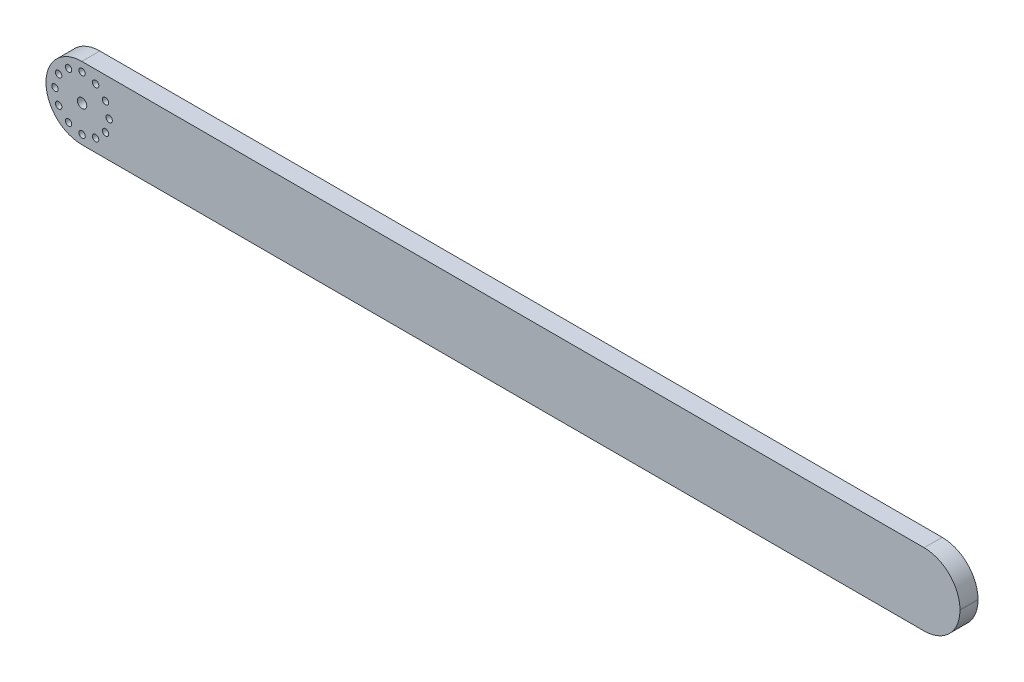
ISO-10303-21;
HEADER;
FILE_DESCRIPTION(('STEP AP214'),'2;1');
FILE_NAME('part.step','',(''),(''),'','','');
FILE_SCHEMA(('AUTOMOTIVE_DESIGN { 1 0 10303 214 1 1 1 1 }'));
ENDSEC;
DATA;
#1=APPLICATION_CONTEXT('core data for automotive mechanical design processes');
#2=APPLICATION_PROTOCOL_DEFINITION('international standard','automotive_design',2000,#1);
#3=PRODUCT_CONTEXT('',#1,'mechanical');
#4=PRODUCT('Part','Part','',(#3));
#5=PRODUCT_RELATED_PRODUCT_CATEGORY('part','',(#4));
#6=PRODUCT_DEFINITION_FORMATION('','',#4);
#7=PRODUCT_DEFINITION_CONTEXT('part definition',#1,'design');
#8=PRODUCT_DEFINITION('design','',#6,#7);
#9=PRODUCT_DEFINITION_SHAPE('','',#8);
#10=(LENGTH_UNIT() NAMED_UNIT(*) SI_UNIT(.MILLI.,.METRE.));
#11=(NAMED_UNIT(*) PLANE_ANGLE_UNIT() SI_UNIT($,.RADIAN.));
#12=(NAMED_UNIT(*) SI_UNIT($,.STERADIAN.) SOLID_ANGLE_UNIT());
#13=UNCERTAINTY_MEASURE_WITH_UNIT(LENGTH_MEASURE(1.E-05),#10,'distance_accuracy_value','');
#14=(GEOMETRIC_REPRESENTATION_CONTEXT(3) GLOBAL_UNCERTAINTY_ASSIGNED_CONTEXT((#13)) GLOBAL_UNIT_ASSIGNED_CONTEXT((#10,
#11,#12)) REPRESENTATION_CONTEXT('',''));
#15=CARTESIAN_POINT('',(0.,0.,0.));
#16=DIRECTION('',(0.,0.,1.));
#17=DIRECTION('',(1.,0.,0.));
#18=AXIS2_PLACEMENT_3D('',#15,#16,#17);
#19=CARTESIAN_POINT('',(927.354,-38.354,0.));
#20=DIRECTION('',(0.,0.,-1.));
#21=DIRECTION('',(-1.,0.,0.));
#22=AXIS2_PLACEMENT_3D('',#19,#20,#21);
#23=PLANE('',#22);
#24=CARTESIAN_POINT('',(52.3875000000003,-13.3533240868598,0.));
#25=DIRECTION('',(0.,0.,1.));
#26=DIRECTION('',(1.,0.,0.));
#27=AXIS2_PLACEMENT_3D('',#24,#25,#26);
#28=CIRCLE('',#27,3.37343749999999);
#29=CARTESIAN_POINT('',(55.7609375000003,-13.3533240868598,0.));
#30=VERTEX_POINT('',#29);
#31=EDGE_CURVE('E287',#30,#30,#28,.T.);
#32=ORIENTED_EDGE('',*,*,#31,.T.);
#33=EDGE_LOOP('',(#32));
#34=FACE_BOUND('',#33,.T.);
#35=CARTESIAN_POINT('',(23.8125000000002,-13.3533240868595,0.));
#36=DIRECTION('',(0.,0.,1.));
#37=DIRECTION('',(1.,0.,0.));
#38=AXIS2_PLACEMENT_3D('',#35,#36,#37);
#39=CIRCLE('',#38,3.37343749999999);
#40=CARTESIAN_POINT('',(27.1859375000002,-13.3533240868595,0.));
#41=VERTEX_POINT('',#40);
#42=EDGE_CURVE('E275',#41,#41,#39,.T.);
#43=ORIENTED_EDGE('',*,*,#42,.T.);
#44=EDGE_LOOP('',(#43));
#45=FACE_BOUND('',#44,.T.);
#46=CARTESIAN_POINT('',(9.52500000000002,-38.0999999999994,0.));
#47=DIRECTION('',(0.,0.,1.));
#48=DIRECTION('',(1.,0.,0.));
#49=AXIS2_PLACEMENT_3D('',#46,#47,#48);
#50=CIRCLE('',#49,3.37343749999999);
#51=CARTESIAN_POINT('',(12.8984375,-38.0999999999994,0.));
#52=VERTEX_POINT('',#51);
#53=EDGE_CURVE('E263',#52,#52,#50,.T.);
#54=ORIENTED_EDGE('',*,*,#53,.T.);
#55=EDGE_LOOP('',(#54));
#56=FACE_BOUND('',#55,.T.);
#57=CARTESIAN_POINT('',(23.8124999999995,-62.8466759131401,0.));
#58=DIRECTION('',(0.,0.,1.));
#59=DIRECTION('',(1.,0.,0.));
#60=AXIS2_PLACEMENT_3D('',#57,#58,#59);
#61=CIRCLE('',#60,3.37343749999999);
#62=CARTESIAN_POINT('',(27.1859374999995,-62.8466759131401,0.));
#63=VERTEX_POINT('',#62);
#64=EDGE_CURVE('E251',#63,#63,#61,.T.);
#65=ORIENTED_EDGE('',*,*,#64,.T.);
#66=EDGE_LOOP('',(#65));
#67=FACE_BOUND('',#66,.T.);
#68=CARTESIAN_POINT('',(52.3874999999996,-62.8466759131406,0.));
#69=DIRECTION('',(0.,0.,1.));
#70=DIRECTION('',(1.,0.,0.));
#71=AXIS2_PLACEMENT_3D('',#68,#69,#70);
#72=CIRCLE('',#71,3.37343749999999);
#73=CARTESIAN_POINT('',(55.7609374999996,-62.8466759131406,0.));
#74=VERTEX_POINT('',#73);
#75=EDGE_CURVE('E239',#74,#74,#72,.T.);
#76=ORIENTED_EDGE('',*,*,#75,.T.);
#77=EDGE_LOOP('',(#76));
#78=FACE_BOUND('',#77,.T.);
#79=CARTESIAN_POINT('',(66.675,-38.1,0.));
#80=DIRECTION('',(0.,0.,1.));
#81=DIRECTION('',(1.,0.,0.));
#82=AXIS2_PLACEMENT_3D('',#79,#80,#81);
#83=CIRCLE('',#82,3.37343749999999);
#84=CARTESIAN_POINT('',(70.0484375,-38.1,0.));
#85=VERTEX_POINT('',#84);
#86=EDGE_CURVE('E227',#85,#85,#83,.T.);
#87=ORIENTED_EDGE('',*,*,#86,.T.);
#88=EDGE_LOOP('',(#87));
#89=FACE_BOUND('',#88,.T.);
#90=CARTESIAN_POINT('',(482.6,-38.1000000000025,0.));
#91=DIRECTION('',(0.,0.,1.));
#92=DIRECTION('',(1.,0.,0.));
#93=AXIS2_PLACEMENT_3D('',#90,#91,#92);
#94=CIRCLE('',#93,16.66875);
#95=CARTESIAN_POINT('',(499.26875,-38.1000000000025,0.));
#96=VERTEX_POINT('',#95);
#97=EDGE_CURVE('E215',#96,#96,#94,.T.);
#98=ORIENTED_EDGE('',*,*,#97,.T.);
#99=EDGE_LOOP('',(#98));
#100=FACE_BOUND('',#99,.T.);
#101=CARTESIAN_POINT('',(723.9,-38.1000000000008,0.));
#102=DIRECTION('',(0.,0.,1.));
#103=DIRECTION('',(1.,0.,0.));
#104=AXIS2_PLACEMENT_3D('',#101,#102,#103);
#105=CIRCLE('',#104,16.66875);
#106=CARTESIAN_POINT('',(740.56875,-38.1000000000008,0.));
#107=VERTEX_POINT('',#106);
#108=EDGE_CURVE('E203',#107,#107,#105,.T.);
#109=ORIENTED_EDGE('',*,*,#108,.T.);
#110=EDGE_LOOP('',(#109));
#111=FACE_BOUND('',#110,.T.);
#112=CARTESIAN_POINT('',(361.95,-38.1000000000034,0.));
#113=DIRECTION('',(0.,0.,1.));
#114=DIRECTION('',(1.,0.,0.));
#115=AXIS2_PLACEMENT_3D('',#112,#113,#114);
#116=CIRCLE('',#115,16.66875);
#117=CARTESIAN_POINT('',(378.61875,-38.1000000000034,0.));
#118=VERTEX_POINT('',#117);
#119=EDGE_CURVE('E191',#118,#118,#116,.T.);
#120=ORIENTED_EDGE('',*,*,#119,.T.);
#121=EDGE_LOOP('',(#120));
#122=FACE_BOUND('',#121,.T.);
#123=CARTESIAN_POINT('',(120.65,-38.1000000000051,0.));
#124=DIRECTION('',(0.,0.,1.));
#125=DIRECTION('',(1.,0.,0.));
#126=AXIS2_PLACEMENT_3D('',#123,#124,#125);
#127=CIRCLE('',#126,16.66875);
#128=CARTESIAN_POINT('',(137.31875,-38.1000000000051,0.));
#129=VERTEX_POINT('',#128);
#130=EDGE_CURVE('E179',#129,#129,#127,.T.);
#131=ORIENTED_EDGE('',*,*,#130,.T.);
#132=EDGE_LOOP('',(#131));
#133=FACE_BOUND('',#132,.T.);
#134=CARTESIAN_POINT('',(927.354,-38.354,0.));
#135=DIRECTION('',(0.,0.,1.));
#136=DIRECTION('',(-1.,0.,0.));
#137=AXIS2_PLACEMENT_3D('',#134,#135,#136);
#138=CIRCLE('',#137,37.8460000000001);
#139=CARTESIAN_POINT('',(927.354,-76.2,0.));
#140=VERTEX_POINT('',#139);
#141=CARTESIAN_POINT('',(965.2,-38.354,0.));
#142=VERTEX_POINT('',#141);
#143=EDGE_CURVE('E131',#140,#142,#138,.T.);
#144=ORIENTED_EDGE('',*,*,#143,.F.);
#145=DIRECTION('',(1.,0.,0.));
#146=VECTOR('',#145,1.);
#147=CARTESIAN_POINT('',(37.846,-76.2,0.));
#148=LINE('',#147,#146);
#149=CARTESIAN_POINT('',(37.846,-76.2,0.));
#150=VERTEX_POINT('',#149);
#151=EDGE_CURVE('E85',#150,#140,#148,.T.);
#152=ORIENTED_EDGE('',*,*,#151,.F.);
#153=CARTESIAN_POINT('',(37.846,-38.354,0.));
#154=DIRECTION('',(0.,0.,1.));
#155=DIRECTION('',(1.,0.,0.));
#156=AXIS2_PLACEMENT_3D('',#153,#154,#155);
#157=CIRCLE('',#156,37.846);
#158=CARTESIAN_POINT('',(0.,-38.354,0.));
#159=VERTEX_POINT('',#158);
#160=EDGE_CURVE('E79',#159,#150,#157,.T.);
#161=ORIENTED_EDGE('',*,*,#160,.F.);
#162=DIRECTION('',(0.,-1.,0.));
#163=VECTOR('',#162,1.);
#164=CARTESIAN_POINT('',(0.,-37.846,0.));
#165=LINE('',#164,#163);
#166=CARTESIAN_POINT('',(0.,-37.846,0.));
#167=VERTEX_POINT('',#166);
#168=EDGE_CURVE('E121',#167,#159,#165,.T.);
#169=ORIENTED_EDGE('',*,*,#168,.F.);
#170=CARTESIAN_POINT('',(37.846,-37.846,0.));
#171=DIRECTION('',(0.,0.,1.));
#172=DIRECTION('',(-1.,0.,0.));
#173=AXIS2_PLACEMENT_3D('',#170,#171,#172);
#174=CIRCLE('',#173,37.846);
#175=CARTESIAN_POINT('',(37.846,0.,0.));
#176=VERTEX_POINT('',#175);
#177=EDGE_CURVE('E141',#176,#167,#174,.T.);
#178=ORIENTED_EDGE('',*,*,#177,.F.);
#179=DIRECTION('',(-1.,0.,0.));
#180=VECTOR('',#179,1.);
#181=CARTESIAN_POINT('',(37.846,0.,0.));
#182=LINE('',#181,#180);
#183=CARTESIAN_POINT('',(927.354,0.,0.));
#184=VERTEX_POINT('',#183);
#185=EDGE_CURVE('E139',#184,#176,#182,.T.);
#186=ORIENTED_EDGE('',*,*,#185,.F.);
#187=CARTESIAN_POINT('',(927.354,-37.846,0.));
#188=DIRECTION('',(0.,0.,1.));
#189=DIRECTION('',(1.,0.,0.));
#190=AXIS2_PLACEMENT_3D('',#187,#188,#189);
#191=CIRCLE('',#190,37.8460000000001);
#192=CARTESIAN_POINT('',(965.2,-37.846,0.));
#193=VERTEX_POINT('',#192);
#194=EDGE_CURVE('E137',#193,#184,#191,.T.);
#195=ORIENTED_EDGE('',*,*,#194,.F.);
#196=DIRECTION('',(0.,1.,0.));
#197=VECTOR('',#196,1.);
#198=CARTESIAN_POINT('',(965.2,-37.846,0.));
#199=LINE('',#198,#197);
#200=EDGE_CURVE('E134',#142,#193,#199,.T.);
#201=ORIENTED_EDGE('',*,*,#200,.F.);
#202=EDGE_LOOP('',(#144,#152,#161,#169,#178,#186,#195,#201));
#203=FACE_BOUND('',#202,.T.);
#204=CARTESIAN_POINT('',(241.3,-38.1000000000042,0.));
#205=DIRECTION('',(0.,0.,1.));
#206=DIRECTION('',(1.,0.,0.));
#207=AXIS2_PLACEMENT_3D('',#204,#205,#206);
#208=CIRCLE('',#207,16.66875);
#209=CARTESIAN_POINT('',(257.96875,-38.1000000000042,0.));
#210=VERTEX_POINT('',#209);
#211=EDGE_CURVE('E185',#210,#210,#208,.T.);
#212=ORIENTED_EDGE('',*,*,#211,.T.);
#213=EDGE_LOOP('',(#212));
#214=FACE_BOUND('',#213,.T.);
#215=CARTESIAN_POINT('',(844.55,-38.1,0.));
#216=DIRECTION('',(0.,0.,1.));
#217=DIRECTION('',(1.,0.,0.));
#218=AXIS2_PLACEMENT_3D('',#215,#216,#217);
#219=CIRCLE('',#218,16.66875);
#220=CARTESIAN_POINT('',(861.21875,-38.1,0.));
#221=VERTEX_POINT('',#220);
#222=EDGE_CURVE('E197',#221,#221,#219,.T.);
#223=ORIENTED_EDGE('',*,*,#222,.T.);
#224=EDGE_LOOP('',(#223));
#225=FACE_BOUND('',#224,.T.);
#226=CARTESIAN_POINT('',(603.25,-38.1000000000017,0.));
#227=DIRECTION('',(0.,0.,1.));
#228=DIRECTION('',(1.,0.,0.));
#229=AXIS2_PLACEMENT_3D('',#226,#227,#228);
#230=CIRCLE('',#229,16.66875);
#231=CARTESIAN_POINT('',(619.91875,-38.1000000000017,0.));
#232=VERTEX_POINT('',#231);
#233=EDGE_CURVE('E209',#232,#232,#230,.T.);
#234=ORIENTED_EDGE('',*,*,#233,.T.);
#235=EDGE_LOOP('',(#234));
#236=FACE_BOUND('',#235,.T.);
#237=CARTESIAN_POINT('',(38.1,-38.1,0.));
#238=DIRECTION('',(0.,0.,1.));
#239=DIRECTION('',(1.,0.,0.));
#240=AXIS2_PLACEMENT_3D('',#237,#238,#239);
#241=CIRCLE('',#240,4.96093750000001);
#242=CARTESIAN_POINT('',(43.0609375,-38.1,0.));
#243=VERTEX_POINT('',#242);
#244=EDGE_CURVE('E221',#243,#243,#241,.T.);
#245=ORIENTED_EDGE('',*,*,#244,.T.);
#246=EDGE_LOOP('',(#245));
#247=FACE_BOUND('',#246,.T.);
#248=CARTESIAN_POINT('',(62.8466759131401,-52.3875000000004,0.));
#249=DIRECTION('',(0.,0.,1.));
#250=DIRECTION('',(1.,0.,0.));
#251=AXIS2_PLACEMENT_3D('',#248,#249,#250);
#252=CIRCLE('',#251,3.37343749999999);
#253=CARTESIAN_POINT('',(66.2201134131401,-52.3875000000004,0.));
#254=VERTEX_POINT('',#253);
#255=EDGE_CURVE('E233',#254,#254,#252,.T.);
#256=ORIENTED_EDGE('',*,*,#255,.T.);
#257=EDGE_LOOP('',(#256));
#258=FACE_BOUND('',#257,.T.);
#259=CARTESIAN_POINT('',(38.0999999999995,-66.675,0.));
#260=DIRECTION('',(0.,0.,1.));
#261=DIRECTION('',(1.,0.,0.));
#262=AXIS2_PLACEMENT_3D('',#259,#260,#261);
#263=CIRCLE('',#262,3.3734375);
#264=CARTESIAN_POINT('',(41.4734374999995,-66.675,0.));
#265=VERTEX_POINT('',#264);
#266=EDGE_CURVE('E245',#265,#265,#263,.T.);
#267=ORIENTED_EDGE('',*,*,#266,.T.);
#268=EDGE_LOOP('',(#267));
#269=FACE_BOUND('',#268,.T.);
#270=CARTESIAN_POINT('',(13.3533240868594,-52.3874999999995,0.));
#271=DIRECTION('',(0.,0.,1.));
#272=DIRECTION('',(1.,0.,0.));
#273=AXIS2_PLACEMENT_3D('',#270,#271,#272);
#274=CIRCLE('',#273,3.37343749999998);
#275=CARTESIAN_POINT('',(16.7267615868594,-52.3874999999995,0.));
#276=VERTEX_POINT('',#275);
#277=EDGE_CURVE('E257',#276,#276,#274,.T.);
#278=ORIENTED_EDGE('',*,*,#277,.T.);
#279=EDGE_LOOP('',(#278));
#280=FACE_BOUND('',#279,.T.);
#281=CARTESIAN_POINT('',(13.35332408686,-23.8124999999995,0.));
#282=DIRECTION('',(0.,0.,1.));
#283=DIRECTION('',(1.,0.,0.));
#284=AXIS2_PLACEMENT_3D('',#281,#282,#283);
#285=CIRCLE('',#284,3.37343749999997);
#286=CARTESIAN_POINT('',(16.72676158686,-23.8124999999995,0.));
#287=VERTEX_POINT('',#286);
#288=EDGE_CURVE('E269',#287,#287,#285,.T.);
#289=ORIENTED_EDGE('',*,*,#288,.T.);
#290=EDGE_LOOP('',(#289));
#291=FACE_BOUND('',#290,.T.);
#292=CARTESIAN_POINT('',(38.1000000000003,-9.52500000000001,0.));
#293=DIRECTION('',(0.,0.,1.));
#294=DIRECTION('',(1.,0.,0.));
#295=AXIS2_PLACEMENT_3D('',#292,#293,#294);
#296=CIRCLE('',#295,3.3734375);
#297=CARTESIAN_POINT('',(41.4734375000003,-9.52500000000001,0.));
#298=VERTEX_POINT('',#297);
#299=EDGE_CURVE('E281',#298,#298,#296,.T.);
#300=ORIENTED_EDGE('',*,*,#299,.T.);
#301=EDGE_LOOP('',(#300));
#302=FACE_BOUND('',#301,.T.);
#303=CARTESIAN_POINT('',(62.8466759131405,-23.8125000000004,0.));
#304=DIRECTION('',(0.,0.,1.));
#305=DIRECTION('',(1.,0.,0.));
#306=AXIS2_PLACEMENT_3D('',#303,#304,#305);
#307=CIRCLE('',#306,3.37343749999998);
#308=CARTESIAN_POINT('',(66.2201134131405,-23.8125000000004,0.));
#309=VERTEX_POINT('',#308);
#310=EDGE_CURVE('E293',#309,#309,#307,.T.);
#311=ORIENTED_EDGE('',*,*,#310,.T.);
#312=EDGE_LOOP('',(#311));
#313=FACE_BOUND('',#312,.T.);
#314=ADVANCED_FACE('F33',(#34,#45,#56,#67,#78,#89,#100,#111,#122,#133,#203,#214,#225,#236,#247,
#258,#269,#280,#291,#302,#313),#23,.T.);
#315=CARTESIAN_POINT('',(927.354,-38.354,19.05));
#316=DIRECTION('',(0.,0.,-1.));
#317=DIRECTION('',(-1.,0.,0.));
#318=AXIS2_PLACEMENT_3D('',#315,#316,#317);
#319=PLANE('',#318);
#320=CARTESIAN_POINT('',(52.3875000000003,-13.3533240868598,19.05));
#321=DIRECTION('',(0.,0.,1.));
#322=DIRECTION('',(1.,0.,0.));
#323=AXIS2_PLACEMENT_3D('',#320,#321,#322);
#324=CIRCLE('',#323,3.37343749999999);
#325=CARTESIAN_POINT('',(55.7609375000003,-13.3533240868598,19.05));
#326=VERTEX_POINT('',#325);
#327=EDGE_CURVE('E284',#326,#326,#324,.T.);
#328=ORIENTED_EDGE('',*,*,#327,.F.);
#329=EDGE_LOOP('',(#328));
#330=FACE_BOUND('',#329,.T.);
#331=CARTESIAN_POINT('',(23.8125000000002,-13.3533240868595,19.05));
#332=DIRECTION('',(0.,0.,1.));
#333=DIRECTION('',(1.,0.,0.));
#334=AXIS2_PLACEMENT_3D('',#331,#332,#333);
#335=CIRCLE('',#334,3.37343749999999);
#336=CARTESIAN_POINT('',(27.1859375000002,-13.3533240868595,19.05));
#337=VERTEX_POINT('',#336);
#338=EDGE_CURVE('E272',#337,#337,#335,.T.);
#339=ORIENTED_EDGE('',*,*,#338,.F.);
#340=EDGE_LOOP('',(#339));
#341=FACE_BOUND('',#340,.T.);
#342=CARTESIAN_POINT('',(9.52500000000002,-38.0999999999994,19.05));
#343=DIRECTION('',(0.,0.,1.));
#344=DIRECTION('',(1.,0.,0.));
#345=AXIS2_PLACEMENT_3D('',#342,#343,#344);
#346=CIRCLE('',#345,3.37343749999999);
#347=CARTESIAN_POINT('',(12.8984375,-38.0999999999994,19.05));
#348=VERTEX_POINT('',#347);
#349=EDGE_CURVE('E260',#348,#348,#346,.T.);
#350=ORIENTED_EDGE('',*,*,#349,.F.);
#351=EDGE_LOOP('',(#350));
#352=FACE_BOUND('',#351,.T.);
#353=CARTESIAN_POINT('',(23.8124999999995,-62.8466759131401,19.05));
#354=DIRECTION('',(0.,0.,1.));
#355=DIRECTION('',(1.,0.,0.));
#356=AXIS2_PLACEMENT_3D('',#353,#354,#355);
#357=CIRCLE('',#356,3.37343749999999);
#358=CARTESIAN_POINT('',(27.1859374999995,-62.8466759131401,19.05));
#359=VERTEX_POINT('',#358);
#360=EDGE_CURVE('E248',#359,#359,#357,.T.);
#361=ORIENTED_EDGE('',*,*,#360,.F.);
#362=EDGE_LOOP('',(#361));
#363=FACE_BOUND('',#362,.T.);
#364=CARTESIAN_POINT('',(52.3874999999996,-62.8466759131406,19.05));
#365=DIRECTION('',(0.,0.,1.));
#366=DIRECTION('',(1.,0.,0.));
#367=AXIS2_PLACEMENT_3D('',#364,#365,#366);
#368=CIRCLE('',#367,3.37343749999999);
#369=CARTESIAN_POINT('',(55.7609374999996,-62.8466759131406,19.05));
#370=VERTEX_POINT('',#369);
#371=EDGE_CURVE('E236',#370,#370,#368,.T.);
#372=ORIENTED_EDGE('',*,*,#371,.F.);
#373=EDGE_LOOP('',(#372));
#374=FACE_BOUND('',#373,.T.);
#375=CARTESIAN_POINT('',(66.675,-38.1,19.05));
#376=DIRECTION('',(0.,0.,1.));
#377=DIRECTION('',(1.,0.,0.));
#378=AXIS2_PLACEMENT_3D('',#375,#376,#377);
#379=CIRCLE('',#378,3.37343749999999);
#380=CARTESIAN_POINT('',(70.0484375,-38.1,19.05));
#381=VERTEX_POINT('',#380);
#382=EDGE_CURVE('E224',#381,#381,#379,.T.);
#383=ORIENTED_EDGE('',*,*,#382,.F.);
#384=EDGE_LOOP('',(#383));
#385=FACE_BOUND('',#384,.T.);
#386=CARTESIAN_POINT('',(927.354,-38.354,19.05));
#387=DIRECTION('',(0.,0.,1.));
#388=DIRECTION('',(-1.,0.,0.));
#389=AXIS2_PLACEMENT_3D('',#386,#387,#388);
#390=CIRCLE('',#389,37.8460000000001);
#391=CARTESIAN_POINT('',(927.354,-76.2,19.05));
#392=VERTEX_POINT('',#391);
#393=CARTESIAN_POINT('',(965.2,-38.354,19.05));
#394=VERTEX_POINT('',#393);
#395=EDGE_CURVE('E146',#392,#394,#390,.T.);
#396=ORIENTED_EDGE('',*,*,#395,.T.);
#397=DIRECTION('',(0.,1.,0.));
#398=VECTOR('',#397,1.);
#399=CARTESIAN_POINT('',(965.2,-37.846,19.05));
#400=LINE('',#399,#398);
#401=CARTESIAN_POINT('',(965.2,-37.846,19.05));
#402=VERTEX_POINT('',#401);
#403=EDGE_CURVE('E93',#394,#402,#400,.T.);
#404=ORIENTED_EDGE('',*,*,#403,.T.);
#405=CARTESIAN_POINT('',(927.354,-37.846,19.05));
#406=DIRECTION('',(0.,0.,1.));
#407=DIRECTION('',(1.,0.,0.));
#408=AXIS2_PLACEMENT_3D('',#405,#406,#407);
#409=CIRCLE('',#408,37.8460000000001);
#410=CARTESIAN_POINT('',(927.354,0.,19.05));
#411=VERTEX_POINT('',#410);
#412=EDGE_CURVE('E161',#402,#411,#409,.T.);
#413=ORIENTED_EDGE('',*,*,#412,.T.);
#414=DIRECTION('',(-1.,0.,0.));
#415=VECTOR('',#414,1.);
#416=CARTESIAN_POINT('',(37.846,0.,19.05));
#417=LINE('',#416,#415);
#418=CARTESIAN_POINT('',(37.846,0.,19.05));
#419=VERTEX_POINT('',#418);
#420=EDGE_CURVE('E173',#411,#419,#417,.T.);
#421=ORIENTED_EDGE('',*,*,#420,.T.);
#422=CARTESIAN_POINT('',(37.846,-37.846,19.05));
#423=DIRECTION('',(0.,0.,1.));
#424=DIRECTION('',(-1.,0.,0.));
#425=AXIS2_PLACEMENT_3D('',#422,#423,#424);
#426=CIRCLE('',#425,37.846);
#427=CARTESIAN_POINT('',(0.,-37.846,19.05));
#428=VERTEX_POINT('',#427);
#429=EDGE_CURVE('E113',#419,#428,#426,.T.);
#430=ORIENTED_EDGE('',*,*,#429,.T.);
#431=DIRECTION('',(0.,-1.,0.));
#432=VECTOR('',#431,1.);
#433=CARTESIAN_POINT('',(0.,-37.846,19.05));
#434=LINE('',#433,#432);
#435=CARTESIAN_POINT('',(0.,-38.354,19.05));
#436=VERTEX_POINT('',#435);
#437=EDGE_CURVE('E106',#428,#436,#434,.T.);
#438=ORIENTED_EDGE('',*,*,#437,.T.);
#439=CARTESIAN_POINT('',(37.846,-38.354,19.05));
#440=DIRECTION('',(0.,0.,1.));
#441=DIRECTION('',(1.,0.,0.));
#442=AXIS2_PLACEMENT_3D('',#439,#440,#441);
#443=CIRCLE('',#442,37.846);
#444=CARTESIAN_POINT('',(37.846,-76.2,19.05));
#445=VERTEX_POINT('',#444);
#446=EDGE_CURVE('E111',#436,#445,#443,.T.);
#447=ORIENTED_EDGE('',*,*,#446,.T.);
#448=DIRECTION('',(1.,0.,0.));
#449=VECTOR('',#448,1.);
#450=CARTESIAN_POINT('',(37.846,-76.2,19.05));
#451=LINE('',#450,#449);
#452=EDGE_CURVE('E50',#445,#392,#451,.T.);
#453=ORIENTED_EDGE('',*,*,#452,.T.);
#454=EDGE_LOOP('',(#396,#404,#413,#421,#430,#438,#447,#453));
#455=FACE_BOUND('',#454,.T.);
#456=CARTESIAN_POINT('',(38.1,-38.1,19.05));
#457=DIRECTION('',(0.,0.,1.));
#458=DIRECTION('',(1.,0.,0.));
#459=AXIS2_PLACEMENT_3D('',#456,#457,#458);
#460=CIRCLE('',#459,4.96093750000001);
#461=CARTESIAN_POINT('',(43.0609375,-38.1,19.05));
#462=VERTEX_POINT('',#461);
#463=EDGE_CURVE('E218',#462,#462,#460,.T.);
#464=ORIENTED_EDGE('',*,*,#463,.F.);
#465=EDGE_LOOP('',(#464));
#466=FACE_BOUND('',#465,.T.);
#467=CARTESIAN_POINT('',(62.8466759131401,-52.3875000000004,19.05));
#468=DIRECTION('',(0.,0.,1.));
#469=DIRECTION('',(1.,0.,0.));
#470=AXIS2_PLACEMENT_3D('',#467,#468,#469);
#471=CIRCLE('',#470,3.37343749999999);
#472=CARTESIAN_POINT('',(66.2201134131401,-52.3875000000004,19.05));
#473=VERTEX_POINT('',#472);
#474=EDGE_CURVE('E230',#473,#473,#471,.T.);
#475=ORIENTED_EDGE('',*,*,#474,.F.);
#476=EDGE_LOOP('',(#475));
#477=FACE_BOUND('',#476,.T.);
#478=CARTESIAN_POINT('',(38.0999999999995,-66.675,19.05));
#479=DIRECTION('',(0.,0.,1.));
#480=DIRECTION('',(1.,0.,0.));
#481=AXIS2_PLACEMENT_3D('',#478,#479,#480);
#482=CIRCLE('',#481,3.3734375);
#483=CARTESIAN_POINT('',(41.4734374999995,-66.675,19.05));
#484=VERTEX_POINT('',#483);
#485=EDGE_CURVE('E242',#484,#484,#482,.T.);
#486=ORIENTED_EDGE('',*,*,#485,.F.);
#487=EDGE_LOOP('',(#486));
#488=FACE_BOUND('',#487,.T.);
#489=CARTESIAN_POINT('',(13.3533240868594,-52.3874999999995,19.05));
#490=DIRECTION('',(0.,0.,1.));
#491=DIRECTION('',(1.,0.,0.));
#492=AXIS2_PLACEMENT_3D('',#489,#490,#491);
#493=CIRCLE('',#492,3.37343749999998);
#494=CARTESIAN_POINT('',(16.7267615868594,-52.3874999999995,19.05));
#495=VERTEX_POINT('',#494);
#496=EDGE_CURVE('E254',#495,#495,#493,.T.);
#497=ORIENTED_EDGE('',*,*,#496,.F.);
#498=EDGE_LOOP('',(#497));
#499=FACE_BOUND('',#498,.T.);
#500=CARTESIAN_POINT('',(13.35332408686,-23.8124999999995,19.05));
#501=DIRECTION('',(0.,0.,1.));
#502=DIRECTION('',(1.,0.,0.));
#503=AXIS2_PLACEMENT_3D('',#500,#501,#502);
#504=CIRCLE('',#503,3.37343749999997);
#505=CARTESIAN_POINT('',(16.72676158686,-23.8124999999995,19.05));
#506=VERTEX_POINT('',#505);
#507=EDGE_CURVE('E266',#506,#506,#504,.T.);
#508=ORIENTED_EDGE('',*,*,#507,.F.);
#509=EDGE_LOOP('',(#508));
#510=FACE_BOUND('',#509,.T.);
#511=CARTESIAN_POINT('',(38.1000000000003,-9.52500000000001,19.05));
#512=DIRECTION('',(0.,0.,1.));
#513=DIRECTION('',(1.,0.,0.));
#514=AXIS2_PLACEMENT_3D('',#511,#512,#513);
#515=CIRCLE('',#514,3.3734375);
#516=CARTESIAN_POINT('',(41.4734375000003,-9.52500000000001,19.05));
#517=VERTEX_POINT('',#516);
#518=EDGE_CURVE('E278',#517,#517,#515,.T.);
#519=ORIENTED_EDGE('',*,*,#518,.F.);
#520=EDGE_LOOP('',(#519));
#521=FACE_BOUND('',#520,.T.);
#522=CARTESIAN_POINT('',(62.8466759131405,-23.8125000000004,19.05));
#523=DIRECTION('',(0.,0.,1.));
#524=DIRECTION('',(1.,0.,0.));
#525=AXIS2_PLACEMENT_3D('',#522,#523,#524);
#526=CIRCLE('',#525,3.37343749999998);
#527=CARTESIAN_POINT('',(66.2201134131405,-23.8125000000004,19.05));
#528=VERTEX_POINT('',#527);
#529=EDGE_CURVE('E290',#528,#528,#526,.T.);
#530=ORIENTED_EDGE('',*,*,#529,.F.);
#531=EDGE_LOOP('',(#530));
#532=FACE_BOUND('',#531,.T.);
#533=ADVANCED_FACE('F108',(#330,#341,#352,#363,#374,#385,#455,#466,#477,#488,#499,#510,#521,
#532),#319,.F.);
#534=CARTESIAN_POINT('',(927.354,-38.354,19.05));
#535=DIRECTION('',(0.,0.,-1.));
#536=DIRECTION('',(-1.,0.,0.));
#537=AXIS2_PLACEMENT_3D('',#534,#535,#536);
#538=CYLINDRICAL_SURFACE('',#537,37.8460000000001);
#539=ORIENTED_EDGE('',*,*,#143,.T.);
#540=DIRECTION('',(0.,0.,-1.));
#541=VECTOR('',#540,1.);
#542=CARTESIAN_POINT('',(965.2,-38.354,19.05));
#543=LINE('',#542,#541);
#544=EDGE_CURVE('E11',#394,#142,#543,.T.);
#545=ORIENTED_EDGE('',*,*,#544,.F.);
#546=ORIENTED_EDGE('',*,*,#395,.F.);
#547=DIRECTION('',(0.,0.,-1.));
#548=VECTOR('',#547,1.);
#549=CARTESIAN_POINT('',(927.354,-76.2,19.05));
#550=LINE('',#549,#548);
#551=EDGE_CURVE('E127',#392,#140,#550,.T.);
#552=ORIENTED_EDGE('',*,*,#551,.T.);
#553=EDGE_LOOP('',(#539,#545,#546,#552));
#554=FACE_BOUND('',#553,.T.);
#555=ADVANCED_FACE('F35',(#554),#538,.T.);
#556=CARTESIAN_POINT('',(965.2,-37.846,19.05));
#557=DIRECTION('',(-1.,0.,0.));
#558=DIRECTION('',(0.,0.,1.));
#559=AXIS2_PLACEMENT_3D('',#556,#557,#558);
#560=PLANE('',#559);
#561=ORIENTED_EDGE('',*,*,#200,.T.);
#562=DIRECTION('',(0.,0.,-1.));
#563=VECTOR('',#562,1.);
#564=CARTESIAN_POINT('',(965.2,-37.846,19.05));
#565=LINE('',#564,#563);
#566=EDGE_CURVE('E42',#402,#193,#565,.T.);
#567=ORIENTED_EDGE('',*,*,#566,.F.);
#568=ORIENTED_EDGE('',*,*,#403,.F.);
#569=ORIENTED_EDGE('',*,*,#544,.T.);
#570=EDGE_LOOP('',(#561,#567,#568,#569));
#571=FACE_BOUND('',#570,.T.);
#572=ADVANCED_FACE('F309',(#571),#560,.F.);
#573=CARTESIAN_POINT('',(927.354,-37.846,19.05));
#574=DIRECTION('',(0.,0.,-1.));
#575=DIRECTION('',(-1.,0.,0.));
#576=AXIS2_PLACEMENT_3D('',#573,#574,#575);
#577=CYLINDRICAL_SURFACE('',#576,37.8460000000001);
#578=ORIENTED_EDGE('',*,*,#194,.T.);
#579=DIRECTION('',(0.,0.,-1.));
#580=VECTOR('',#579,1.);
#581=CARTESIAN_POINT('',(927.354,0.,19.05));
#582=LINE('',#581,#580);
#583=EDGE_CURVE('E153',#411,#184,#582,.T.);
#584=ORIENTED_EDGE('',*,*,#583,.F.);
#585=ORIENTED_EDGE('',*,*,#412,.F.);
#586=ORIENTED_EDGE('',*,*,#566,.T.);
#587=EDGE_LOOP('',(#578,#584,#585,#586));
#588=FACE_BOUND('',#587,.T.);
#589=ADVANCED_FACE('F159',(#588),#577,.T.);
#590=CARTESIAN_POINT('',(37.846,0.,19.05));
#591=DIRECTION('',(0.,-1.,0.));
#592=DIRECTION('',(0.,0.,-1.));
#593=AXIS2_PLACEMENT_3D('',#590,#591,#592);
#594=PLANE('',#593);
#595=ORIENTED_EDGE('',*,*,#185,.T.);
#596=DIRECTION('',(0.,0.,-1.));
#597=VECTOR('',#596,1.);
#598=CARTESIAN_POINT('',(37.846,0.,19.05));
#599=LINE('',#598,#597);
#600=EDGE_CURVE('E150',#419,#176,#599,.T.);
#601=ORIENTED_EDGE('',*,*,#600,.F.);
#602=ORIENTED_EDGE('',*,*,#420,.F.);
#603=ORIENTED_EDGE('',*,*,#583,.T.);
#604=EDGE_LOOP('',(#595,#601,#602,#603));
#605=FACE_BOUND('',#604,.T.);
#606=ADVANCED_FACE('F169',(#605),#594,.F.);
#607=CARTESIAN_POINT('',(37.846,-37.846,19.05));
#608=DIRECTION('',(0.,0.,-1.));
#609=DIRECTION('',(-1.,0.,0.));
#610=AXIS2_PLACEMENT_3D('',#607,#608,#609);
#611=CYLINDRICAL_SURFACE('',#610,37.846);
#612=ORIENTED_EDGE('',*,*,#177,.T.);
#613=DIRECTION('',(0.,0.,-1.));
#614=VECTOR('',#613,1.);
#615=CARTESIAN_POINT('',(0.,-37.846,19.05));
#616=LINE('',#615,#614);
#617=EDGE_CURVE('E122',#428,#167,#616,.T.);
#618=ORIENTED_EDGE('',*,*,#617,.F.);
#619=ORIENTED_EDGE('',*,*,#429,.F.);
#620=ORIENTED_EDGE('',*,*,#600,.T.);
#621=EDGE_LOOP('',(#612,#618,#619,#620));
#622=FACE_BOUND('',#621,.T.);
#623=ADVANCED_FACE('F172',(#622),#611,.T.);
#624=CARTESIAN_POINT('',(0.,-37.846,19.05));
#625=DIRECTION('',(1.,0.,0.));
#626=DIRECTION('',(0.,0.,-1.));
#627=AXIS2_PLACEMENT_3D('',#624,#625,#626);
#628=PLANE('',#627);
#629=ORIENTED_EDGE('',*,*,#168,.T.);
#630=DIRECTION('',(0.,0.,-1.));
#631=VECTOR('',#630,1.);
#632=CARTESIAN_POINT('',(0.,-38.354,19.05));
#633=LINE('',#632,#631);
#634=EDGE_CURVE('E118',#436,#159,#633,.T.);
#635=ORIENTED_EDGE('',*,*,#634,.F.);
#636=ORIENTED_EDGE('',*,*,#437,.F.);
#637=ORIENTED_EDGE('',*,*,#617,.T.);
#638=EDGE_LOOP('',(#629,#635,#636,#637));
#639=FACE_BOUND('',#638,.T.);
#640=ADVANCED_FACE('F119',(#639),#628,.F.);
#641=CARTESIAN_POINT('',(37.846,-38.354,19.05));
#642=DIRECTION('',(0.,0.,-1.));
#643=DIRECTION('',(-1.,0.,0.));
#644=AXIS2_PLACEMENT_3D('',#641,#642,#643);
#645=CYLINDRICAL_SURFACE('',#644,37.846);
#646=ORIENTED_EDGE('',*,*,#160,.T.);
#647=DIRECTION('',(0.,0.,-1.));
#648=VECTOR('',#647,1.);
#649=CARTESIAN_POINT('',(37.846,-76.2,19.05));
#650=LINE('',#649,#648);
#651=EDGE_CURVE('E123',#445,#150,#650,.T.);
#652=ORIENTED_EDGE('',*,*,#651,.F.);
#653=ORIENTED_EDGE('',*,*,#446,.F.);
#654=ORIENTED_EDGE('',*,*,#634,.T.);
#655=EDGE_LOOP('',(#646,#652,#653,#654));
#656=FACE_BOUND('',#655,.T.);
#657=ADVANCED_FACE('F125',(#656),#645,.T.);
#658=CARTESIAN_POINT('',(37.846,-76.2,19.05));
#659=DIRECTION('',(0.,1.,0.));
#660=DIRECTION('',(-1.,0.,0.));
#661=AXIS2_PLACEMENT_3D('',#658,#659,#660);
#662=PLANE('',#661);
#663=ORIENTED_EDGE('',*,*,#151,.T.);
#664=ORIENTED_EDGE('',*,*,#551,.F.);
#665=ORIENTED_EDGE('',*,*,#452,.F.);
#666=ORIENTED_EDGE('',*,*,#651,.T.);
#667=EDGE_LOOP('',(#663,#664,#665,#666));
#668=FACE_BOUND('',#667,.T.);
#669=ADVANCED_FACE('F319',(#668),#662,.F.);
#670=CARTESIAN_POINT('',(120.65,-38.1000000000051,9.525));
#671=DIRECTION('',(0.,0.,-1.));
#672=DIRECTION('',(-1.,0.,0.));
#673=AXIS2_PLACEMENT_3D('',#670,#671,#672);
#674=CYLINDRICAL_SURFACE('',#673,16.66875);
#675=CARTESIAN_POINT('',(120.65,-38.1000000000051,9.525));
#676=DIRECTION('',(0.,0.,1.));
#677=DIRECTION('',(1.,0.,0.));
#678=AXIS2_PLACEMENT_3D('',#675,#676,#677);
#679=CIRCLE('',#678,16.66875);
#680=CARTESIAN_POINT('',(137.31875,-38.1000000000051,9.525));
#681=VERTEX_POINT('',#680);
#682=EDGE_CURVE('E135',#681,#681,#679,.T.);
#683=ORIENTED_EDGE('',*,*,#682,.T.);
#684=EDGE_LOOP('',(#683));
#685=FACE_BOUND('',#684,.T.);
#686=ORIENTED_EDGE('',*,*,#130,.F.);
#687=EDGE_LOOP('',(#686));
#688=FACE_BOUND('',#687,.T.);
#689=ADVANCED_FACE('F316',(#685,#688),#674,.F.);
#690=CARTESIAN_POINT('',(0.,0.,9.525));
#691=DIRECTION('',(0.,0.,1.));
#692=DIRECTION('',(1.,0.,0.));
#693=AXIS2_PLACEMENT_3D('',#690,#691,#692);
#694=PLANE('',#693);
#695=ORIENTED_EDGE('',*,*,#682,.F.);
#696=EDGE_LOOP('',(#695));
#697=FACE_BOUND('',#696,.T.);
#698=ADVANCED_FACE('F368',(#697),#694,.F.);
#699=CARTESIAN_POINT('',(241.3,-38.1000000000042,9.525));
#700=DIRECTION('',(0.,0.,-1.));
#701=DIRECTION('',(-1.,0.,0.));
#702=AXIS2_PLACEMENT_3D('',#699,#700,#701);
#703=CYLINDRICAL_SURFACE('',#702,16.66875);
#704=CARTESIAN_POINT('',(241.3,-38.1000000000042,9.525));
#705=DIRECTION('',(0.,0.,1.));
#706=DIRECTION('',(1.,0.,0.));
#707=AXIS2_PLACEMENT_3D('',#704,#705,#706);
#708=CIRCLE('',#707,16.66875);
#709=CARTESIAN_POINT('',(257.96875,-38.1000000000042,9.525));
#710=VERTEX_POINT('',#709);
#711=EDGE_CURVE('E182',#710,#710,#708,.T.);
#712=ORIENTED_EDGE('',*,*,#711,.T.);
#713=EDGE_LOOP('',(#712));
#714=FACE_BOUND('',#713,.T.);
#715=ORIENTED_EDGE('',*,*,#211,.F.);
#716=EDGE_LOOP('',(#715));
#717=FACE_BOUND('',#716,.T.);
#718=ADVANCED_FACE('F375',(#714,#717),#703,.F.);
#719=CARTESIAN_POINT('',(0.,0.,9.525));
#720=DIRECTION('',(0.,0.,1.));
#721=DIRECTION('',(1.,0.,0.));
#722=AXIS2_PLACEMENT_3D('',#719,#720,#721);
#723=PLANE('',#722);
#724=ORIENTED_EDGE('',*,*,#711,.F.);
#725=EDGE_LOOP('',(#724));
#726=FACE_BOUND('',#725,.T.);
#727=ADVANCED_FACE('F382',(#726),#723,.F.);
#728=CARTESIAN_POINT('',(361.95,-38.1000000000034,9.525));
#729=DIRECTION('',(0.,0.,-1.));
#730=DIRECTION('',(-1.,0.,0.));
#731=AXIS2_PLACEMENT_3D('',#728,#729,#730);
#732=CYLINDRICAL_SURFACE('',#731,16.66875);
#733=CARTESIAN_POINT('',(361.95,-38.1000000000034,9.525));
#734=DIRECTION('',(0.,0.,1.));
#735=DIRECTION('',(1.,0.,0.));
#736=AXIS2_PLACEMENT_3D('',#733,#734,#735);
#737=CIRCLE('',#736,16.66875);
#738=CARTESIAN_POINT('',(378.61875,-38.1000000000034,9.525));
#739=VERTEX_POINT('',#738);
#740=EDGE_CURVE('E188',#739,#739,#737,.T.);
#741=ORIENTED_EDGE('',*,*,#740,.T.);
#742=EDGE_LOOP('',(#741));
#743=FACE_BOUND('',#742,.T.);
#744=ORIENTED_EDGE('',*,*,#119,.F.);
#745=EDGE_LOOP('',(#744));
#746=FACE_BOUND('',#745,.T.);
#747=ADVANCED_FACE('F390',(#743,#746),#732,.F.);
#748=CARTESIAN_POINT('',(0.,0.,9.525));
#749=DIRECTION('',(0.,0.,1.));
#750=DIRECTION('',(1.,0.,0.));
#751=AXIS2_PLACEMENT_3D('',#748,#749,#750);
#752=PLANE('',#751);
#753=ORIENTED_EDGE('',*,*,#740,.F.);
#754=EDGE_LOOP('',(#753));
#755=FACE_BOUND('',#754,.T.);
#756=ADVANCED_FACE('F398',(#755),#752,.F.);
#757=CARTESIAN_POINT('',(844.55,-38.1,9.525));
#758=DIRECTION('',(0.,0.,-1.));
#759=DIRECTION('',(-1.,0.,0.));
#760=AXIS2_PLACEMENT_3D('',#757,#758,#759);
#761=CYLINDRICAL_SURFACE('',#760,16.66875);
#762=CARTESIAN_POINT('',(844.55,-38.1,9.525));
#763=DIRECTION('',(0.,0.,1.));
#764=DIRECTION('',(1.,0.,0.));
#765=AXIS2_PLACEMENT_3D('',#762,#763,#764);
#766=CIRCLE('',#765,16.66875);
#767=CARTESIAN_POINT('',(861.21875,-38.1,9.525));
#768=VERTEX_POINT('',#767);
#769=EDGE_CURVE('E194',#768,#768,#766,.T.);
#770=ORIENTED_EDGE('',*,*,#769,.T.);
#771=EDGE_LOOP('',(#770));
#772=FACE_BOUND('',#771,.T.);
#773=ORIENTED_EDGE('',*,*,#222,.F.);
#774=EDGE_LOOP('',(#773));
#775=FACE_BOUND('',#774,.T.);
#776=ADVANCED_FACE('F406',(#772,#775),#761,.F.);
#777=CARTESIAN_POINT('',(0.,0.,9.525));
#778=DIRECTION('',(0.,0.,1.));
#779=DIRECTION('',(1.,0.,0.));
#780=AXIS2_PLACEMENT_3D('',#777,#778,#779);
#781=PLANE('',#780);
#782=ORIENTED_EDGE('',*,*,#769,.F.);
#783=EDGE_LOOP('',(#782));
#784=FACE_BOUND('',#783,.T.);
#785=ADVANCED_FACE('F414',(#784),#781,.F.);
#786=CARTESIAN_POINT('',(723.9,-38.1000000000008,9.525));
#787=DIRECTION('',(0.,0.,-1.));
#788=DIRECTION('',(-1.,0.,0.));
#789=AXIS2_PLACEMENT_3D('',#786,#787,#788);
#790=CYLINDRICAL_SURFACE('',#789,16.66875);
#791=CARTESIAN_POINT('',(723.9,-38.1000000000008,9.525));
#792=DIRECTION('',(0.,0.,1.));
#793=DIRECTION('',(1.,0.,0.));
#794=AXIS2_PLACEMENT_3D('',#791,#792,#793);
#795=CIRCLE('',#794,16.66875);
#796=CARTESIAN_POINT('',(740.56875,-38.1000000000008,9.525));
#797=VERTEX_POINT('',#796);
#798=EDGE_CURVE('E200',#797,#797,#795,.T.);
#799=ORIENTED_EDGE('',*,*,#798,.T.);
#800=EDGE_LOOP('',(#799));
#801=FACE_BOUND('',#800,.T.);
#802=ORIENTED_EDGE('',*,*,#108,.F.);
#803=EDGE_LOOP('',(#802));
#804=FACE_BOUND('',#803,.T.);
#805=ADVANCED_FACE('F422',(#801,#804),#790,.F.);
#806=CARTESIAN_POINT('',(0.,0.,9.525));
#807=DIRECTION('',(0.,0.,1.));
#808=DIRECTION('',(1.,0.,0.));
#809=AXIS2_PLACEMENT_3D('',#806,#807,#808);
#810=PLANE('',#809);
#811=ORIENTED_EDGE('',*,*,#798,.F.);
#812=EDGE_LOOP('',(#811));
#813=FACE_BOUND('',#812,.T.);
#814=ADVANCED_FACE('F430',(#813),#810,.F.);
#815=CARTESIAN_POINT('',(603.25,-38.1000000000017,9.525));
#816=DIRECTION('',(0.,0.,-1.));
#817=DIRECTION('',(-1.,0.,0.));
#818=AXIS2_PLACEMENT_3D('',#815,#816,#817);
#819=CYLINDRICAL_SURFACE('',#818,16.66875);
#820=CARTESIAN_POINT('',(603.25,-38.1000000000017,9.525));
#821=DIRECTION('',(0.,0.,1.));
#822=DIRECTION('',(1.,0.,0.));
#823=AXIS2_PLACEMENT_3D('',#820,#821,#822);
#824=CIRCLE('',#823,16.66875);
#825=CARTESIAN_POINT('',(619.91875,-38.1000000000017,9.525));
#826=VERTEX_POINT('',#825);
#827=EDGE_CURVE('E206',#826,#826,#824,.T.);
#828=ORIENTED_EDGE('',*,*,#827,.T.);
#829=EDGE_LOOP('',(#828));
#830=FACE_BOUND('',#829,.T.);
#831=ORIENTED_EDGE('',*,*,#233,.F.);
#832=EDGE_LOOP('',(#831));
#833=FACE_BOUND('',#832,.T.);
#834=ADVANCED_FACE('F438',(#830,#833),#819,.F.);
#835=CARTESIAN_POINT('',(0.,0.,9.525));
#836=DIRECTION('',(0.,0.,1.));
#837=DIRECTION('',(1.,0.,0.));
#838=AXIS2_PLACEMENT_3D('',#835,#836,#837);
#839=PLANE('',#838);
#840=ORIENTED_EDGE('',*,*,#827,.F.);
#841=EDGE_LOOP('',(#840));
#842=FACE_BOUND('',#841,.T.);
#843=ADVANCED_FACE('F446',(#842),#839,.F.);
#844=CARTESIAN_POINT('',(482.6,-38.1000000000025,9.525));
#845=DIRECTION('',(0.,0.,-1.));
#846=DIRECTION('',(-1.,0.,0.));
#847=AXIS2_PLACEMENT_3D('',#844,#845,#846);
#848=CYLINDRICAL_SURFACE('',#847,16.66875);
#849=CARTESIAN_POINT('',(482.6,-38.1000000000025,9.525));
#850=DIRECTION('',(0.,0.,1.));
#851=DIRECTION('',(1.,0.,0.));
#852=AXIS2_PLACEMENT_3D('',#849,#850,#851);
#853=CIRCLE('',#852,16.66875);
#854=CARTESIAN_POINT('',(499.26875,-38.1000000000025,9.525));
#855=VERTEX_POINT('',#854);
#856=EDGE_CURVE('E212',#855,#855,#853,.T.);
#857=ORIENTED_EDGE('',*,*,#856,.T.);
#858=EDGE_LOOP('',(#857));
#859=FACE_BOUND('',#858,.T.);
#860=ORIENTED_EDGE('',*,*,#97,.F.);
#861=EDGE_LOOP('',(#860));
#862=FACE_BOUND('',#861,.T.);
#863=ADVANCED_FACE('F454',(#859,#862),#848,.F.);
#864=CARTESIAN_POINT('',(0.,0.,9.525));
#865=DIRECTION('',(0.,0.,1.));
#866=DIRECTION('',(1.,0.,0.));
#867=AXIS2_PLACEMENT_3D('',#864,#865,#866);
#868=PLANE('',#867);
#869=ORIENTED_EDGE('',*,*,#856,.F.);
#870=EDGE_LOOP('',(#869));
#871=FACE_BOUND('',#870,.T.);
#872=ADVANCED_FACE('F462',(#871),#868,.F.);
#873=CARTESIAN_POINT('',(38.1,-38.1,19.05));
#874=DIRECTION('',(0.,0.,-1.));
#875=DIRECTION('',(-1.,0.,0.));
#876=AXIS2_PLACEMENT_3D('',#873,#874,#875);
#877=CYLINDRICAL_SURFACE('',#876,4.96093750000001);
#878=ORIENTED_EDGE('',*,*,#463,.T.);
#879=EDGE_LOOP('',(#878));
#880=FACE_BOUND('',#879,.T.);
#881=ORIENTED_EDGE('',*,*,#244,.F.);
#882=EDGE_LOOP('',(#881));
#883=FACE_BOUND('',#882,.T.);
#884=ADVANCED_FACE('F470',(#880,#883),#877,.F.);
#885=CARTESIAN_POINT('',(66.675,-38.1,19.05));
#886=DIRECTION('',(0.,0.,-1.));
#887=DIRECTION('',(-1.,0.,0.));
#888=AXIS2_PLACEMENT_3D('',#885,#886,#887);
#889=CYLINDRICAL_SURFACE('',#888,3.37343749999999);
#890=ORIENTED_EDGE('',*,*,#382,.T.);
#891=EDGE_LOOP('',(#890));
#892=FACE_BOUND('',#891,.T.);
#893=ORIENTED_EDGE('',*,*,#86,.F.);
#894=EDGE_LOOP('',(#893));
#895=FACE_BOUND('',#894,.T.);
#896=ADVANCED_FACE('F479',(#892,#895),#889,.F.);
#897=CARTESIAN_POINT('',(62.8466759131401,-52.3875000000004,19.05));
#898=DIRECTION('',(0.,0.,-1.));
#899=DIRECTION('',(-1.,0.,0.));
#900=AXIS2_PLACEMENT_3D('',#897,#898,#899);
#901=CYLINDRICAL_SURFACE('',#900,3.37343749999999);
#902=ORIENTED_EDGE('',*,*,#474,.T.);
#903=EDGE_LOOP('',(#902));
#904=FACE_BOUND('',#903,.T.);
#905=ORIENTED_EDGE('',*,*,#255,.F.);
#906=EDGE_LOOP('',(#905));
#907=FACE_BOUND('',#906,.T.);
#908=ADVANCED_FACE('F487',(#904,#907),#901,.F.);
#909=CARTESIAN_POINT('',(52.3874999999996,-62.8466759131406,19.05));
#910=DIRECTION('',(0.,0.,-1.));
#911=DIRECTION('',(-1.,0.,0.));
#912=AXIS2_PLACEMENT_3D('',#909,#910,#911);
#913=CYLINDRICAL_SURFACE('',#912,3.37343749999999);
#914=ORIENTED_EDGE('',*,*,#371,.T.);
#915=EDGE_LOOP('',(#914));
#916=FACE_BOUND('',#915,.T.);
#917=ORIENTED_EDGE('',*,*,#75,.F.);
#918=EDGE_LOOP('',(#917));
#919=FACE_BOUND('',#918,.T.);
#920=ADVANCED_FACE('F495',(#916,#919),#913,.F.);
#921=CARTESIAN_POINT('',(38.0999999999995,-66.675,19.05));
#922=DIRECTION('',(0.,0.,-1.));
#923=DIRECTION('',(-1.,0.,0.));
#924=AXIS2_PLACEMENT_3D('',#921,#922,#923);
#925=CYLINDRICAL_SURFACE('',#924,3.3734375);
#926=ORIENTED_EDGE('',*,*,#485,.T.);
#927=EDGE_LOOP('',(#926));
#928=FACE_BOUND('',#927,.T.);
#929=ORIENTED_EDGE('',*,*,#266,.F.);
#930=EDGE_LOOP('',(#929));
#931=FACE_BOUND('',#930,.T.);
#932=ADVANCED_FACE('F503',(#928,#931),#925,.F.);
#933=CARTESIAN_POINT('',(23.8124999999995,-62.8466759131401,19.05));
#934=DIRECTION('',(0.,0.,-1.));
#935=DIRECTION('',(-1.,0.,0.));
#936=AXIS2_PLACEMENT_3D('',#933,#934,#935);
#937=CYLINDRICAL_SURFACE('',#936,3.37343749999999);
#938=ORIENTED_EDGE('',*,*,#360,.T.);
#939=EDGE_LOOP('',(#938));
#940=FACE_BOUND('',#939,.T.);
#941=ORIENTED_EDGE('',*,*,#64,.F.);
#942=EDGE_LOOP('',(#941));
#943=FACE_BOUND('',#942,.T.);
#944=ADVANCED_FACE('F511',(#940,#943),#937,.F.);
#945=CARTESIAN_POINT('',(13.3533240868594,-52.3874999999995,19.05));
#946=DIRECTION('',(0.,0.,-1.));
#947=DIRECTION('',(-1.,0.,0.));
#948=AXIS2_PLACEMENT_3D('',#945,#946,#947);
#949=CYLINDRICAL_SURFACE('',#948,3.37343749999998);
#950=ORIENTED_EDGE('',*,*,#496,.T.);
#951=EDGE_LOOP('',(#950));
#952=FACE_BOUND('',#951,.T.);
#953=ORIENTED_EDGE('',*,*,#277,.F.);
#954=EDGE_LOOP('',(#953));
#955=FACE_BOUND('',#954,.T.);
#956=ADVANCED_FACE('F519',(#952,#955),#949,.F.);
#957=CARTESIAN_POINT('',(9.52500000000002,-38.0999999999994,19.05));
#958=DIRECTION('',(0.,0.,-1.));
#959=DIRECTION('',(-1.,0.,0.));
#960=AXIS2_PLACEMENT_3D('',#957,#958,#959);
#961=CYLINDRICAL_SURFACE('',#960,3.37343749999999);
#962=ORIENTED_EDGE('',*,*,#349,.T.);
#963=EDGE_LOOP('',(#962));
#964=FACE_BOUND('',#963,.T.);
#965=ORIENTED_EDGE('',*,*,#53,.F.);
#966=EDGE_LOOP('',(#965));
#967=FACE_BOUND('',#966,.T.);
#968=ADVANCED_FACE('F527',(#964,#967),#961,.F.);
#969=CARTESIAN_POINT('',(13.35332408686,-23.8124999999995,19.05));
#970=DIRECTION('',(0.,0.,-1.));
#971=DIRECTION('',(-1.,0.,0.));
#972=AXIS2_PLACEMENT_3D('',#969,#970,#971);
#973=CYLINDRICAL_SURFACE('',#972,3.37343749999997);
#974=ORIENTED_EDGE('',*,*,#507,.T.);
#975=EDGE_LOOP('',(#974));
#976=FACE_BOUND('',#975,.T.);
#977=ORIENTED_EDGE('',*,*,#288,.F.);
#978=EDGE_LOOP('',(#977));
#979=FACE_BOUND('',#978,.T.);
#980=ADVANCED_FACE('F535',(#976,#979),#973,.F.);
#981=CARTESIAN_POINT('',(23.8125000000002,-13.3533240868595,19.05));
#982=DIRECTION('',(0.,0.,-1.));
#983=DIRECTION('',(-1.,0.,0.));
#984=AXIS2_PLACEMENT_3D('',#981,#982,#983);
#985=CYLINDRICAL_SURFACE('',#984,3.37343749999999);
#986=ORIENTED_EDGE('',*,*,#338,.T.);
#987=EDGE_LOOP('',(#986));
#988=FACE_BOUND('',#987,.T.);
#989=ORIENTED_EDGE('',*,*,#42,.F.);
#990=EDGE_LOOP('',(#989));
#991=FACE_BOUND('',#990,.T.);
#992=ADVANCED_FACE('F543',(#988,#991),#985,.F.);
#993=CARTESIAN_POINT('',(38.1000000000003,-9.52500000000001,19.05));
#994=DIRECTION('',(0.,0.,-1.));
#995=DIRECTION('',(-1.,0.,0.));
#996=AXIS2_PLACEMENT_3D('',#993,#994,#995);
#997=CYLINDRICAL_SURFACE('',#996,3.3734375);
#998=ORIENTED_EDGE('',*,*,#518,.T.);
#999=EDGE_LOOP('',(#998));
#1000=FACE_BOUND('',#999,.T.);
#1001=ORIENTED_EDGE('',*,*,#299,.F.);
#1002=EDGE_LOOP('',(#1001));
#1003=FACE_BOUND('',#1002,.T.);
#1004=ADVANCED_FACE('F551',(#1000,#1003),#997,.F.);
#1005=CARTESIAN_POINT('',(52.3875000000003,-13.3533240868598,19.05));
#1006=DIRECTION('',(0.,0.,-1.));
#1007=DIRECTION('',(-1.,0.,0.));
#1008=AXIS2_PLACEMENT_3D('',#1005,#1006,#1007);
#1009=CYLINDRICAL_SURFACE('',#1008,3.37343749999999);
#1010=ORIENTED_EDGE('',*,*,#327,.T.);
#1011=EDGE_LOOP('',(#1010));
#1012=FACE_BOUND('',#1011,.T.);
#1013=ORIENTED_EDGE('',*,*,#31,.F.);
#1014=EDGE_LOOP('',(#1013));
#1015=FACE_BOUND('',#1014,.T.);
#1016=ADVANCED_FACE('F559',(#1012,#1015),#1009,.F.);
#1017=CARTESIAN_POINT('',(62.8466759131405,-23.8125000000004,19.05));
#1018=DIRECTION('',(0.,0.,-1.));
#1019=DIRECTION('',(-1.,0.,0.));
#1020=AXIS2_PLACEMENT_3D('',#1017,#1018,#1019);
#1021=CYLINDRICAL_SURFACE('',#1020,3.37343749999998);
#1022=ORIENTED_EDGE('',*,*,#529,.T.);
#1023=EDGE_LOOP('',(#1022));
#1024=FACE_BOUND('',#1023,.T.);
#1025=ORIENTED_EDGE('',*,*,#310,.F.);
#1026=EDGE_LOOP('',(#1025));
#1027=FACE_BOUND('',#1026,.T.);
#1028=ADVANCED_FACE('F299',(#1024,#1027),#1021,.F.);
#1029=CLOSED_SHELL('',(#314,#533,#555,#572,#589,#606,#623,#640,#657,#669,#689,#698,#718,#727,
#747,#756,#776,#785,#805,#814,#834,#843,#863,#872,#884,#896,#908,#920,#932,#944,#956,#968,#980,
#992,#1004,#1016,#1028));
#1030=MANIFOLD_SOLID_BREP('B2',#1029);
#1031=ADVANCED_BREP_SHAPE_REPRESENTATION('',(#18,#1030),#14);
#1032=SHAPE_DEFINITION_REPRESENTATION(#9,#1031);
ENDSEC;
END-ISO-10303-21;
